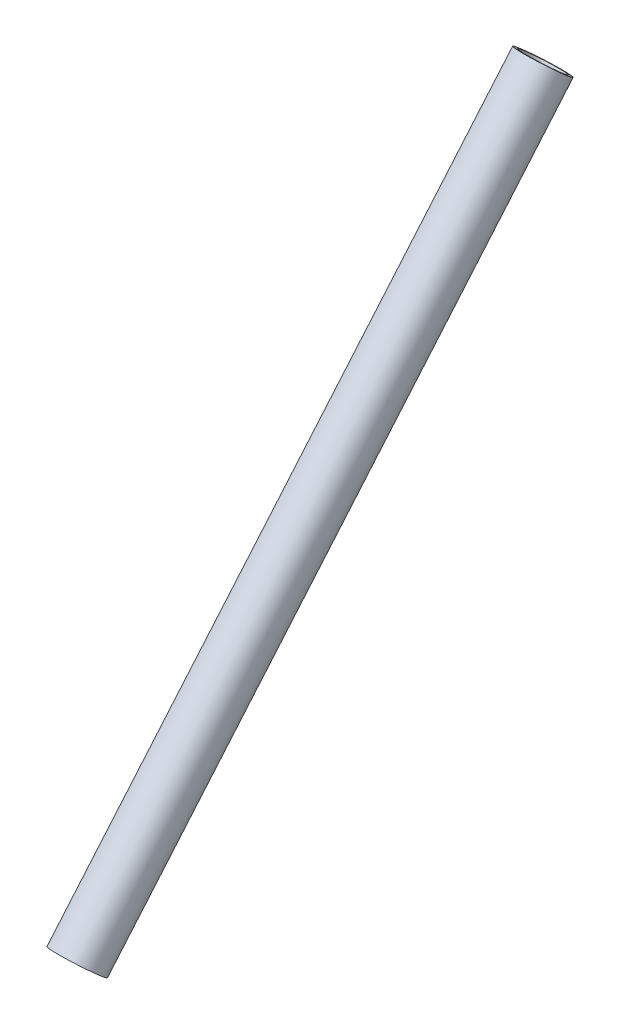
ISO-10303-21;
HEADER;
FILE_DESCRIPTION(('STEP AP214'),'2;1');
FILE_NAME('part.step','',(''),(''),'','','');
FILE_SCHEMA(('AUTOMOTIVE_DESIGN { 1 0 10303 214 1 1 1 1 }'));
ENDSEC;
DATA;
#1=APPLICATION_CONTEXT('core data for automotive mechanical design processes');
#2=APPLICATION_PROTOCOL_DEFINITION('international standard','automotive_design',2000,#1);
#3=PRODUCT_CONTEXT('',#1,'mechanical');
#4=PRODUCT('Part','Part','',(#3));
#5=PRODUCT_RELATED_PRODUCT_CATEGORY('part','',(#4));
#6=PRODUCT_DEFINITION_FORMATION('','',#4);
#7=PRODUCT_DEFINITION_CONTEXT('part definition',#1,'design');
#8=PRODUCT_DEFINITION('design','',#6,#7);
#9=PRODUCT_DEFINITION_SHAPE('','',#8);
#10=(LENGTH_UNIT() NAMED_UNIT(*) SI_UNIT(.MILLI.,.METRE.));
#11=(NAMED_UNIT(*) PLANE_ANGLE_UNIT() SI_UNIT($,.RADIAN.));
#12=(NAMED_UNIT(*) SI_UNIT($,.STERADIAN.) SOLID_ANGLE_UNIT());
#13=UNCERTAINTY_MEASURE_WITH_UNIT(LENGTH_MEASURE(1.E-05),#10,'distance_accuracy_value','');
#14=(GEOMETRIC_REPRESENTATION_CONTEXT(3) GLOBAL_UNCERTAINTY_ASSIGNED_CONTEXT((#13)) GLOBAL_UNIT_ASSIGNED_CONTEXT((#10,
#11,#12)) REPRESENTATION_CONTEXT('',''));
#15=CARTESIAN_POINT('',(0.,0.,0.));
#16=DIRECTION('',(0.,0.,1.));
#17=DIRECTION('',(1.,0.,0.));
#18=AXIS2_PLACEMENT_3D('',#15,#16,#17);
#19=CARTESIAN_POINT('',(0.,186.017674286312,203.056046645412));
#20=DIRECTION('',(0.,-0.76140894996316,0.648271864973329));
#21=DIRECTION('',(0.,-0.648271864973329,-0.76140894996316));
#22=AXIS2_PLACEMENT_3D('',#19,#20,#21);
#23=PLANE('',#22);
#24=CARTESIAN_POINT('',(0.,182.128043096472,198.487592945633));
#25=DIRECTION('',(0.,-0.76140894996316,0.648271864973329));
#26=DIRECTION('',(0.,-0.648271864973329,-0.76140894996316));
#27=AXIS2_PLACEMENT_3D('',#24,#25,#26);
#28=CIRCLE('',#27,6.00000000000006);
#29=CARTESIAN_POINT('',(0.,178.238411906632,193.919139245854));
#30=VERTEX_POINT('',#29);
#31=EDGE_CURVE('E45',#30,#30,#28,.T.);
#32=ORIENTED_EDGE('',*,*,#31,.F.);
#33=EDGE_LOOP('',(#32));
#34=FACE_BOUND('',#33,.T.);
#35=CARTESIAN_POINT('',(0.,182.128043096472,198.487592945633));
#36=DIRECTION('',(0.,-0.76140894996316,0.648271864973329));
#37=DIRECTION('',(0.,-0.648271864973329,-0.76140894996316));
#38=AXIS2_PLACEMENT_3D('',#35,#36,#37);
#39=CIRCLE('',#38,5.00000000000139);
#40=CARTESIAN_POINT('',(0.,178.886683771605,194.680548195816));
#41=VERTEX_POINT('',#40);
#42=EDGE_CURVE('E10',#41,#41,#39,.T.);
#43=ORIENTED_EDGE('',*,*,#42,.T.);
#44=EDGE_LOOP('',(#43));
#45=FACE_BOUND('',#44,.T.);
#46=ADVANCED_FACE('F31',(#34,#45),#23,.F.);
#47=CARTESIAN_POINT('',(0.,1.47451495458029E-12,353.553390593276));
#48=DIRECTION('',(0.,-0.76140894996316,0.648271864973329));
#49=DIRECTION('',(0.,-0.648271864973329,-0.76140894996316));
#50=AXIS2_PLACEMENT_3D('',#47,#48,#49);
#51=CYLINDRICAL_SURFACE('',#50,5.00000000000011);
#52=ORIENTED_EDGE('',*,*,#42,.F.);
#53=EDGE_LOOP('',(#52));
#54=FACE_BOUND('',#53,.T.);
#55=CARTESIAN_POINT('',(0.,45.9380861781287,314.441204163841));
#56=DIRECTION('',(0.,-0.76140894996316,0.648271864973329));
#57=DIRECTION('',(0.,-0.648271864973329,-0.76140894996316));
#58=AXIS2_PLACEMENT_3D('',#55,#56,#57);
#59=CIRCLE('',#58,4.99999999999883);
#60=CARTESIAN_POINT('',(0.,42.6967268532628,310.634159414026));
#61=VERTEX_POINT('',#60);
#62=EDGE_CURVE('E37',#61,#61,#59,.T.);
#63=ORIENTED_EDGE('',*,*,#62,.T.);
#64=EDGE_LOOP('',(#63));
#65=FACE_BOUND('',#64,.T.);
#66=ADVANCED_FACE('F54',(#54,#65),#51,.F.);
#67=CARTESIAN_POINT('',(0.,49.827717367968,319.009657863619));
#68=DIRECTION('',(0.,0.76140894996316,-0.648271864973329));
#69=DIRECTION('',(0.,0.648271864973329,0.76140894996316));
#70=AXIS2_PLACEMENT_3D('',#67,#68,#69);
#71=PLANE('',#70);
#72=ORIENTED_EDGE('',*,*,#62,.F.);
#73=EDGE_LOOP('',(#72));
#74=FACE_BOUND('',#73,.T.);
#75=CARTESIAN_POINT('',(0.,45.9380861781287,314.441204163841));
#76=DIRECTION('',(0.,-0.76140894996316,0.648271864973329));
#77=DIRECTION('',(0.,-0.648271864973329,-0.76140894996316));
#78=AXIS2_PLACEMENT_3D('',#75,#76,#77);
#79=CIRCLE('',#78,5.99999999999892);
#80=CARTESIAN_POINT('',(0.,42.0484549882894,309.872750464062));
#81=VERTEX_POINT('',#80);
#82=EDGE_CURVE('E41',#81,#81,#79,.T.);
#83=ORIENTED_EDGE('',*,*,#82,.T.);
#84=EDGE_LOOP('',(#83));
#85=FACE_BOUND('',#84,.T.);
#86=ADVANCED_FACE('F58',(#74,#85),#71,.F.);
#87=CARTESIAN_POINT('',(0.,1.47451495458029E-12,353.553390593276));
#88=DIRECTION('',(0.,-0.76140894996316,0.648271864973329));
#89=DIRECTION('',(0.,-0.648271864973329,-0.76140894996316));
#90=AXIS2_PLACEMENT_3D('',#87,#88,#89);
#91=CYLINDRICAL_SURFACE('',#90,5.99999999999951);
#92=ORIENTED_EDGE('',*,*,#82,.F.);
#93=EDGE_LOOP('',(#92));
#94=FACE_BOUND('',#93,.T.);
#95=ORIENTED_EDGE('',*,*,#31,.T.);
#96=EDGE_LOOP('',(#95));
#97=FACE_BOUND('',#96,.T.);
#98=ADVANCED_FACE('F51',(#94,#97),#91,.T.);
#99=CLOSED_SHELL('',(#46,#66,#86,#98));
#100=MANIFOLD_SOLID_BREP('B2',#99);
#101=ADVANCED_BREP_SHAPE_REPRESENTATION('',(#18,#100),#14);
#102=SHAPE_DEFINITION_REPRESENTATION(#9,#101);
ENDSEC;
END-ISO-10303-21;
